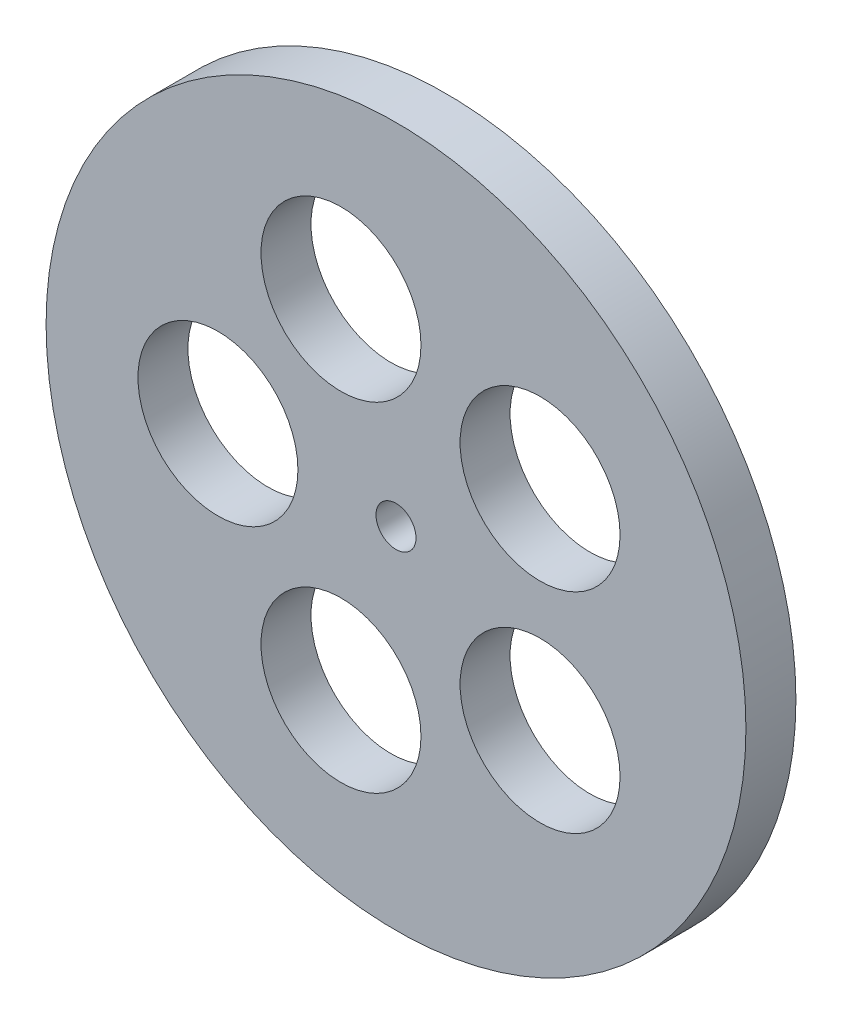
ISO-10303-21;
HEADER;
FILE_DESCRIPTION(('STEP AP214'),'2;1');
FILE_NAME('part.step','',(''),(''),'','','');
FILE_SCHEMA(('AUTOMOTIVE_DESIGN { 1 0 10303 214 1 1 1 1 }'));
ENDSEC;
DATA;
#1=APPLICATION_CONTEXT('core data for automotive mechanical design processes');
#2=APPLICATION_PROTOCOL_DEFINITION('international standard','automotive_design',2000,#1);
#3=PRODUCT_CONTEXT('',#1,'mechanical');
#4=PRODUCT('Part','Part','',(#3));
#5=PRODUCT_RELATED_PRODUCT_CATEGORY('part','',(#4));
#6=PRODUCT_DEFINITION_FORMATION('','',#4);
#7=PRODUCT_DEFINITION_CONTEXT('part definition',#1,'design');
#8=PRODUCT_DEFINITION('design','',#6,#7);
#9=PRODUCT_DEFINITION_SHAPE('','',#8);
#10=(LENGTH_UNIT() NAMED_UNIT(*) SI_UNIT(.MILLI.,.METRE.));
#11=(NAMED_UNIT(*) PLANE_ANGLE_UNIT() SI_UNIT($,.RADIAN.));
#12=(NAMED_UNIT(*) SI_UNIT($,.STERADIAN.) SOLID_ANGLE_UNIT());
#13=UNCERTAINTY_MEASURE_WITH_UNIT(LENGTH_MEASURE(1.E-05),#10,'distance_accuracy_value','');
#14=(GEOMETRIC_REPRESENTATION_CONTEXT(3) GLOBAL_UNCERTAINTY_ASSIGNED_CONTEXT((#13)) GLOBAL_UNIT_ASSIGNED_CONTEXT((#10,
#11,#12)) REPRESENTATION_CONTEXT('',''));
#15=CARTESIAN_POINT('',(0.,0.,0.));
#16=DIRECTION('',(0.,0.,1.));
#17=DIRECTION('',(1.,0.,0.));
#18=AXIS2_PLACEMENT_3D('',#15,#16,#17);
#19=CARTESIAN_POINT('',(0.,0.,5.));
#20=DIRECTION('',(0.,0.,1.));
#21=DIRECTION('',(1.,0.,0.));
#22=AXIS2_PLACEMENT_3D('',#19,#20,#21);
#23=PLANE('',#22);
#24=CARTESIAN_POINT('',(-5.50367594545531,-16.9385728512746,5.));
#25=DIRECTION('',(0.,0.,1.));
#26=DIRECTION('',(1.,0.,0.));
#27=AXIS2_PLACEMENT_3D('',#24,#25,#26);
#28=CIRCLE('',#27,8.);
#29=CARTESIAN_POINT('',(2.49632405454469,-16.9385728512746,5.));
#30=VERTEX_POINT('',#29);
#31=EDGE_CURVE('E63',#30,#30,#28,.T.);
#32=ORIENTED_EDGE('',*,*,#31,.F.);
#33=EDGE_LOOP('',(#32));
#34=FACE_BOUND('',#33,.T.);
#35=CARTESIAN_POINT('',(14.4088106882666,-10.4686137430041,5.));
#36=DIRECTION('',(0.,0.,1.));
#37=DIRECTION('',(1.,0.,0.));
#38=AXIS2_PLACEMENT_3D('',#35,#36,#37);
#39=CIRCLE('',#38,8.);
#40=CARTESIAN_POINT('',(22.4088106882666,-10.4686137430041,5.));
#41=VERTEX_POINT('',#40);
#42=EDGE_CURVE('E69',#41,#41,#39,.T.);
#43=ORIENTED_EDGE('',*,*,#42,.F.);
#44=EDGE_LOOP('',(#43));
#45=FACE_BOUND('',#44,.T.);
#46=CARTESIAN_POINT('',(14.4088106882668,10.4686137430039,5.));
#47=DIRECTION('',(0.,0.,1.));
#48=DIRECTION('',(1.,0.,0.));
#49=AXIS2_PLACEMENT_3D('',#46,#47,#48);
#50=CIRCLE('',#49,8.);
#51=CARTESIAN_POINT('',(22.4088106882668,10.4686137430039,5.));
#52=VERTEX_POINT('',#51);
#53=EDGE_CURVE('E75',#52,#52,#50,.T.);
#54=ORIENTED_EDGE('',*,*,#53,.F.);
#55=EDGE_LOOP('',(#54));
#56=FACE_BOUND('',#55,.T.);
#57=CARTESIAN_POINT('',(-5.50367594545507,16.9385728512747,5.));
#58=DIRECTION('',(0.,0.,1.));
#59=DIRECTION('',(1.,0.,0.));
#60=AXIS2_PLACEMENT_3D('',#57,#58,#59);
#61=CIRCLE('',#60,8.);
#62=CARTESIAN_POINT('',(2.49632405454493,16.9385728512747,5.));
#63=VERTEX_POINT('',#62);
#64=EDGE_CURVE('E81',#63,#63,#61,.T.);
#65=ORIENTED_EDGE('',*,*,#64,.F.);
#66=EDGE_LOOP('',(#65));
#67=FACE_BOUND('',#66,.T.);
#68=CARTESIAN_POINT('',(-17.8102694856232,0.,5.));
#69=DIRECTION('',(0.,0.,1.));
#70=DIRECTION('',(1.,0.,0.));
#71=AXIS2_PLACEMENT_3D('',#68,#69,#70);
#72=CIRCLE('',#71,8.);
#73=CARTESIAN_POINT('',(-9.81026948562317,0.,5.));
#74=VERTEX_POINT('',#73);
#75=EDGE_CURVE('E57',#74,#74,#72,.T.);
#76=ORIENTED_EDGE('',*,*,#75,.F.);
#77=EDGE_LOOP('',(#76));
#78=FACE_BOUND('',#77,.T.);
#79=CARTESIAN_POINT('',(0.,0.,5.));
#80=DIRECTION('',(0.,0.,1.));
#81=DIRECTION('',(1.,0.,0.));
#82=AXIS2_PLACEMENT_3D('',#79,#80,#81);
#83=CIRCLE('',#82,35.);
#84=CARTESIAN_POINT('',(35.,0.,5.));
#85=VERTEX_POINT('',#84);
#86=EDGE_CURVE('E10',#85,#85,#83,.T.);
#87=ORIENTED_EDGE('',*,*,#86,.T.);
#88=EDGE_LOOP('',(#87));
#89=FACE_BOUND('',#88,.T.);
#90=CARTESIAN_POINT('',(0.,0.,5.));
#91=DIRECTION('',(0.,0.,1.));
#92=DIRECTION('',(1.,0.,0.));
#93=AXIS2_PLACEMENT_3D('',#90,#91,#92);
#94=CIRCLE('',#93,2.);
#95=CARTESIAN_POINT('',(2.,0.,5.));
#96=VERTEX_POINT('',#95);
#97=EDGE_CURVE('E49',#96,#96,#94,.T.);
#98=ORIENTED_EDGE('',*,*,#97,.F.);
#99=EDGE_LOOP('',(#98));
#100=FACE_BOUND('',#99,.T.);
#101=ADVANCED_FACE('F38',(#34,#45,#56,#67,#78,#89,#100),#23,.T.);
#102=CARTESIAN_POINT('',(0.,0.,0.));
#103=DIRECTION('',(0.,0.,1.));
#104=DIRECTION('',(1.,0.,0.));
#105=AXIS2_PLACEMENT_3D('',#102,#103,#104);
#106=PLANE('',#105);
#107=CARTESIAN_POINT('',(-5.50367594545531,-16.9385728512746,0.));
#108=DIRECTION('',(0.,0.,1.));
#109=DIRECTION('',(1.,0.,0.));
#110=AXIS2_PLACEMENT_3D('',#107,#108,#109);
#111=CIRCLE('',#110,8.);
#112=CARTESIAN_POINT('',(2.49632405454469,-16.9385728512746,0.));
#113=VERTEX_POINT('',#112);
#114=EDGE_CURVE('E66',#113,#113,#111,.T.);
#115=ORIENTED_EDGE('',*,*,#114,.T.);
#116=EDGE_LOOP('',(#115));
#117=FACE_BOUND('',#116,.T.);
#118=CARTESIAN_POINT('',(14.4088106882666,-10.4686137430041,0.));
#119=DIRECTION('',(0.,0.,1.));
#120=DIRECTION('',(1.,0.,0.));
#121=AXIS2_PLACEMENT_3D('',#118,#119,#120);
#122=CIRCLE('',#121,8.);
#123=CARTESIAN_POINT('',(22.4088106882666,-10.4686137430041,0.));
#124=VERTEX_POINT('',#123);
#125=EDGE_CURVE('E72',#124,#124,#122,.T.);
#126=ORIENTED_EDGE('',*,*,#125,.T.);
#127=EDGE_LOOP('',(#126));
#128=FACE_BOUND('',#127,.T.);
#129=CARTESIAN_POINT('',(14.4088106882668,10.4686137430039,0.));
#130=DIRECTION('',(0.,0.,1.));
#131=DIRECTION('',(1.,0.,0.));
#132=AXIS2_PLACEMENT_3D('',#129,#130,#131);
#133=CIRCLE('',#132,8.);
#134=CARTESIAN_POINT('',(22.4088106882668,10.4686137430039,0.));
#135=VERTEX_POINT('',#134);
#136=EDGE_CURVE('E78',#135,#135,#133,.T.);
#137=ORIENTED_EDGE('',*,*,#136,.T.);
#138=EDGE_LOOP('',(#137));
#139=FACE_BOUND('',#138,.T.);
#140=CARTESIAN_POINT('',(-5.50367594545507,16.9385728512747,0.));
#141=DIRECTION('',(0.,0.,1.));
#142=DIRECTION('',(1.,0.,0.));
#143=AXIS2_PLACEMENT_3D('',#140,#141,#142);
#144=CIRCLE('',#143,8.);
#145=CARTESIAN_POINT('',(2.49632405454493,16.9385728512747,0.));
#146=VERTEX_POINT('',#145);
#147=EDGE_CURVE('E60',#146,#146,#144,.T.);
#148=ORIENTED_EDGE('',*,*,#147,.T.);
#149=EDGE_LOOP('',(#148));
#150=FACE_BOUND('',#149,.T.);
#151=CARTESIAN_POINT('',(-17.8102694856232,0.,0.));
#152=DIRECTION('',(0.,0.,1.));
#153=DIRECTION('',(1.,0.,0.));
#154=AXIS2_PLACEMENT_3D('',#151,#152,#153);
#155=CIRCLE('',#154,8.);
#156=CARTESIAN_POINT('',(-9.81026948562317,0.,0.));
#157=VERTEX_POINT('',#156);
#158=EDGE_CURVE('E54',#157,#157,#155,.T.);
#159=ORIENTED_EDGE('',*,*,#158,.T.);
#160=EDGE_LOOP('',(#159));
#161=FACE_BOUND('',#160,.T.);
#162=CARTESIAN_POINT('',(0.,0.,0.));
#163=DIRECTION('',(0.,0.,1.));
#164=DIRECTION('',(1.,0.,0.));
#165=AXIS2_PLACEMENT_3D('',#162,#163,#164);
#166=CIRCLE('',#165,35.);
#167=CARTESIAN_POINT('',(35.,0.,0.));
#168=VERTEX_POINT('',#167);
#169=EDGE_CURVE('E42',#168,#168,#166,.T.);
#170=ORIENTED_EDGE('',*,*,#169,.F.);
#171=EDGE_LOOP('',(#170));
#172=FACE_BOUND('',#171,.T.);
#173=CARTESIAN_POINT('',(0.,0.,0.));
#174=DIRECTION('',(0.,0.,1.));
#175=DIRECTION('',(1.,0.,0.));
#176=AXIS2_PLACEMENT_3D('',#173,#174,#175);
#177=CIRCLE('',#176,2.);
#178=CARTESIAN_POINT('',(2.,0.,0.));
#179=VERTEX_POINT('',#178);
#180=EDGE_CURVE('E51',#179,#179,#177,.T.);
#181=ORIENTED_EDGE('',*,*,#180,.T.);
#182=EDGE_LOOP('',(#181));
#183=FACE_BOUND('',#182,.T.);
#184=ADVANCED_FACE('F87',(#117,#128,#139,#150,#161,#172,#183),#106,.F.);
#185=CARTESIAN_POINT('',(0.,0.,5.));
#186=DIRECTION('',(0.,0.,-1.));
#187=DIRECTION('',(-1.,0.,0.));
#188=AXIS2_PLACEMENT_3D('',#185,#186,#187);
#189=CYLINDRICAL_SURFACE('',#188,35.);
#190=ORIENTED_EDGE('',*,*,#86,.F.);
#191=EDGE_LOOP('',(#190));
#192=FACE_BOUND('',#191,.T.);
#193=ORIENTED_EDGE('',*,*,#169,.T.);
#194=EDGE_LOOP('',(#193));
#195=FACE_BOUND('',#194,.T.);
#196=ADVANCED_FACE('F40',(#192,#195),#189,.T.);
#197=CARTESIAN_POINT('',(0.,0.,5.));
#198=DIRECTION('',(0.,0.,-1.));
#199=DIRECTION('',(-1.,0.,0.));
#200=AXIS2_PLACEMENT_3D('',#197,#198,#199);
#201=CYLINDRICAL_SURFACE('',#200,2.);
#202=ORIENTED_EDGE('',*,*,#97,.T.);
#203=EDGE_LOOP('',(#202));
#204=FACE_BOUND('',#203,.T.);
#205=ORIENTED_EDGE('',*,*,#180,.F.);
#206=EDGE_LOOP('',(#205));
#207=FACE_BOUND('',#206,.T.);
#208=ADVANCED_FACE('F106',(#204,#207),#201,.F.);
#209=CARTESIAN_POINT('',(-17.8102694856232,0.,0.));
#210=DIRECTION('',(0.,0.,1.));
#211=DIRECTION('',(1.,0.,0.));
#212=AXIS2_PLACEMENT_3D('',#209,#210,#211);
#213=CYLINDRICAL_SURFACE('',#212,8.);
#214=ORIENTED_EDGE('',*,*,#158,.F.);
#215=EDGE_LOOP('',(#214));
#216=FACE_BOUND('',#215,.T.);
#217=ORIENTED_EDGE('',*,*,#75,.T.);
#218=EDGE_LOOP('',(#217));
#219=FACE_BOUND('',#218,.T.);
#220=ADVANCED_FACE('F94',(#216,#219),#213,.F.);
#221=CARTESIAN_POINT('',(-5.50367594545507,16.9385728512747,0.));
#222=DIRECTION('',(0.,0.,1.));
#223=DIRECTION('',(1.,0.,0.));
#224=AXIS2_PLACEMENT_3D('',#221,#222,#223);
#225=CYLINDRICAL_SURFACE('',#224,8.);
#226=ORIENTED_EDGE('',*,*,#147,.F.);
#227=EDGE_LOOP('',(#226));
#228=FACE_BOUND('',#227,.T.);
#229=ORIENTED_EDGE('',*,*,#64,.T.);
#230=EDGE_LOOP('',(#229));
#231=FACE_BOUND('',#230,.T.);
#232=ADVANCED_FACE('F90',(#228,#231),#225,.F.);
#233=CARTESIAN_POINT('',(14.4088106882668,10.4686137430039,0.));
#234=DIRECTION('',(0.,0.,1.));
#235=DIRECTION('',(1.,0.,0.));
#236=AXIS2_PLACEMENT_3D('',#233,#234,#235);
#237=CYLINDRICAL_SURFACE('',#236,8.);
#238=ORIENTED_EDGE('',*,*,#136,.F.);
#239=EDGE_LOOP('',(#238));
#240=FACE_BOUND('',#239,.T.);
#241=ORIENTED_EDGE('',*,*,#53,.T.);
#242=EDGE_LOOP('',(#241));
#243=FACE_BOUND('',#242,.T.);
#244=ADVANCED_FACE('F93',(#240,#243),#237,.F.);
#245=CARTESIAN_POINT('',(14.4088106882666,-10.4686137430041,0.));
#246=DIRECTION('',(0.,0.,1.));
#247=DIRECTION('',(1.,0.,0.));
#248=AXIS2_PLACEMENT_3D('',#245,#246,#247);
#249=CYLINDRICAL_SURFACE('',#248,8.);
#250=ORIENTED_EDGE('',*,*,#125,.F.);
#251=EDGE_LOOP('',(#250));
#252=FACE_BOUND('',#251,.T.);
#253=ORIENTED_EDGE('',*,*,#42,.T.);
#254=EDGE_LOOP('',(#253));
#255=FACE_BOUND('',#254,.T.);
#256=ADVANCED_FACE('F126',(#252,#255),#249,.F.);
#257=CARTESIAN_POINT('',(-5.50367594545531,-16.9385728512746,0.));
#258=DIRECTION('',(0.,0.,1.));
#259=DIRECTION('',(1.,0.,0.));
#260=AXIS2_PLACEMENT_3D('',#257,#258,#259);
#261=CYLINDRICAL_SURFACE('',#260,8.);
#262=ORIENTED_EDGE('',*,*,#114,.F.);
#263=EDGE_LOOP('',(#262));
#264=FACE_BOUND('',#263,.T.);
#265=ORIENTED_EDGE('',*,*,#31,.T.);
#266=EDGE_LOOP('',(#265));
#267=FACE_BOUND('',#266,.T.);
#268=ADVANCED_FACE('F123',(#264,#267),#261,.F.);
#269=CLOSED_SHELL('',(#101,#184,#196,#208,#220,#232,#244,#256,#268));
#270=MANIFOLD_SOLID_BREP('B2',#269);
#271=ADVANCED_BREP_SHAPE_REPRESENTATION('',(#18,#270),#14);
#272=SHAPE_DEFINITION_REPRESENTATION(#9,#271);
ENDSEC;
END-ISO-10303-21;
